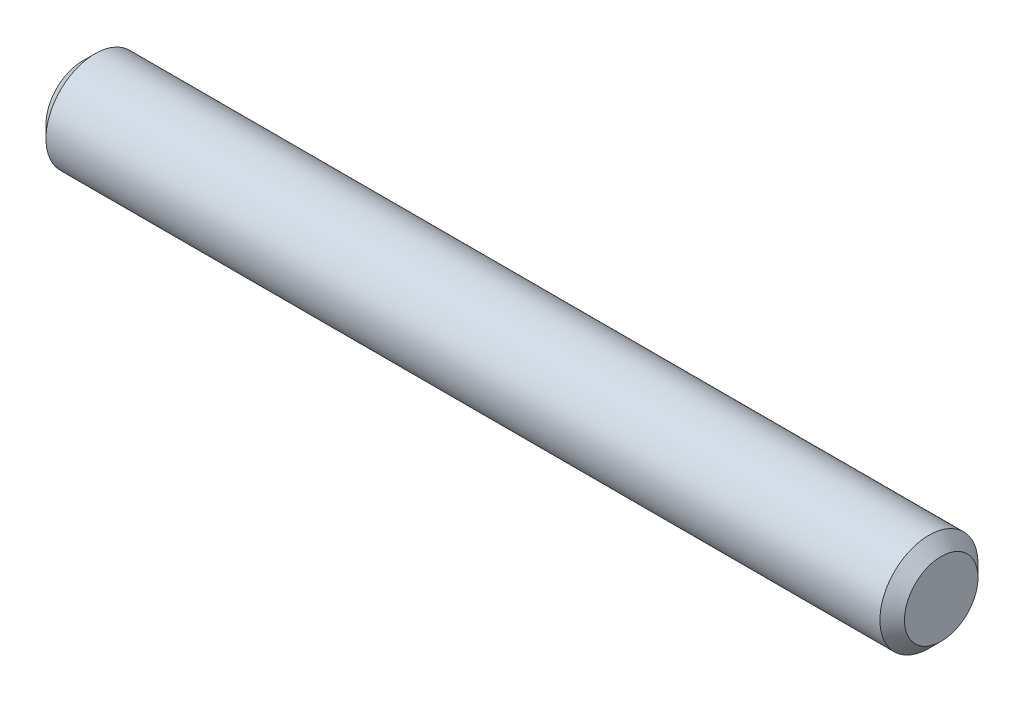
ISO-10303-21;
HEADER;
FILE_DESCRIPTION(('STEP AP214'),'2;1');
FILE_NAME('part.step','',(''),(''),'','','');
FILE_SCHEMA(('AUTOMOTIVE_DESIGN { 1 0 10303 214 1 1 1 1 }'));
ENDSEC;
DATA;
#1=APPLICATION_CONTEXT('core data for automotive mechanical design processes');
#2=APPLICATION_PROTOCOL_DEFINITION('international standard','automotive_design',2000,#1);
#3=PRODUCT_CONTEXT('',#1,'mechanical');
#4=PRODUCT('Part','Part','',(#3));
#5=PRODUCT_RELATED_PRODUCT_CATEGORY('part','',(#4));
#6=PRODUCT_DEFINITION_FORMATION('','',#4);
#7=PRODUCT_DEFINITION_CONTEXT('part definition',#1,'design');
#8=PRODUCT_DEFINITION('design','',#6,#7);
#9=PRODUCT_DEFINITION_SHAPE('','',#8);
#10=(LENGTH_UNIT() NAMED_UNIT(*) SI_UNIT(.MILLI.,.METRE.));
#11=(NAMED_UNIT(*) PLANE_ANGLE_UNIT() SI_UNIT($,.RADIAN.));
#12=(NAMED_UNIT(*) SI_UNIT($,.STERADIAN.) SOLID_ANGLE_UNIT());
#13=UNCERTAINTY_MEASURE_WITH_UNIT(LENGTH_MEASURE(1.E-05),#10,'distance_accuracy_value','');
#14=(GEOMETRIC_REPRESENTATION_CONTEXT(3) GLOBAL_UNCERTAINTY_ASSIGNED_CONTEXT((#13)) GLOBAL_UNIT_ASSIGNED_CONTEXT((#10,
#11,#12)) REPRESENTATION_CONTEXT('',''));
#15=CARTESIAN_POINT('',(0.,0.,0.));
#16=DIRECTION('',(0.,0.,1.));
#17=DIRECTION('',(1.,0.,0.));
#18=AXIS2_PLACEMENT_3D('',#15,#16,#17);
#19=CARTESIAN_POINT('',(17.5,0.,0.));
#20=DIRECTION('',(-1.,0.,0.));
#21=DIRECTION('',(0.,0.,1.));
#22=AXIS2_PLACEMENT_3D('',#19,#20,#21);
#23=CYLINDRICAL_SURFACE('',#22,2.);
#24=CARTESIAN_POINT('',(-17.,0.,0.));
#25=DIRECTION('',(1.,0.,0.));
#26=DIRECTION('',(0.,0.,-1.));
#27=AXIS2_PLACEMENT_3D('',#24,#25,#26);
#28=CIRCLE('',#27,2.);
#29=CARTESIAN_POINT('',(-17.,0.,-2.));
#30=VERTEX_POINT('',#29);
#31=EDGE_CURVE('E50',#30,#30,#28,.T.);
#32=ORIENTED_EDGE('',*,*,#31,.T.);
#33=EDGE_LOOP('',(#32));
#34=FACE_BOUND('',#33,.T.);
#35=CARTESIAN_POINT('',(17.,0.,0.));
#36=DIRECTION('',(1.,0.,0.));
#37=DIRECTION('',(0.,0.,-1.));
#38=AXIS2_PLACEMENT_3D('',#35,#36,#37);
#39=CIRCLE('',#38,2.);
#40=CARTESIAN_POINT('',(17.,0.,-2.));
#41=VERTEX_POINT('',#40);
#42=EDGE_CURVE('E54',#41,#41,#39,.F.);
#43=ORIENTED_EDGE('',*,*,#42,.T.);
#44=EDGE_LOOP('',(#43));
#45=FACE_BOUND('',#44,.T.);
#46=ADVANCED_FACE('F37',(#34,#45),#23,.T.);
#47=CARTESIAN_POINT('',(17.5,0.,0.));
#48=DIRECTION('',(1.,0.,0.));
#49=DIRECTION('',(0.,0.,-1.));
#50=AXIS2_PLACEMENT_3D('',#47,#48,#49);
#51=PLANE('',#50);
#52=CARTESIAN_POINT('',(17.5,0.,0.));
#53=DIRECTION('',(1.,0.,0.));
#54=DIRECTION('',(0.,0.,-1.));
#55=AXIS2_PLACEMENT_3D('',#52,#53,#54);
#56=CIRCLE('',#55,1.5);
#57=CARTESIAN_POINT('',(17.5,0.,-1.5));
#58=VERTEX_POINT('',#57);
#59=EDGE_CURVE('E10',#58,#58,#56,.T.);
#60=ORIENTED_EDGE('',*,*,#59,.T.);
#61=EDGE_LOOP('',(#60));
#62=FACE_BOUND('',#61,.T.);
#63=ADVANCED_FACE('F69',(#62),#51,.T.);
#64=CARTESIAN_POINT('',(-17.5,0.,0.));
#65=DIRECTION('',(1.,0.,0.));
#66=DIRECTION('',(0.,0.,-1.));
#67=AXIS2_PLACEMENT_3D('',#64,#65,#66);
#68=PLANE('',#67);
#69=CARTESIAN_POINT('',(-17.5,0.,0.));
#70=DIRECTION('',(1.,0.,0.));
#71=DIRECTION('',(0.,0.,-1.));
#72=AXIS2_PLACEMENT_3D('',#69,#70,#71);
#73=CIRCLE('',#72,1.49999999999999);
#74=CARTESIAN_POINT('',(-17.5,0.,-1.49999999999999));
#75=VERTEX_POINT('',#74);
#76=EDGE_CURVE('E45',#75,#75,#73,.F.);
#77=ORIENTED_EDGE('',*,*,#76,.T.);
#78=EDGE_LOOP('',(#77));
#79=FACE_BOUND('',#78,.T.);
#80=ADVANCED_FACE('F67',(#79),#68,.F.);
#81=CARTESIAN_POINT('',(-17.,0.,0.));
#82=DIRECTION('',(1.,0.,0.));
#83=DIRECTION('',(0.,0.,-1.));
#84=AXIS2_PLACEMENT_3D('',#81,#82,#83);
#85=CONICAL_SURFACE('',#84,2.,0.785398163397457);
#86=ORIENTED_EDGE('',*,*,#76,.F.);
#87=EDGE_LOOP('',(#86));
#88=FACE_BOUND('',#87,.T.);
#89=ORIENTED_EDGE('',*,*,#31,.F.);
#90=EDGE_LOOP('',(#89));
#91=FACE_BOUND('',#90,.T.);
#92=ADVANCED_FACE('F63',(#88,#91),#85,.T.);
#93=CARTESIAN_POINT('',(17.5,0.,0.));
#94=DIRECTION('',(-1.,0.,0.));
#95=DIRECTION('',(0.,0.,1.));
#96=AXIS2_PLACEMENT_3D('',#93,#94,#95);
#97=CONICAL_SURFACE('',#96,1.5,0.785398163397443);
#98=ORIENTED_EDGE('',*,*,#42,.F.);
#99=EDGE_LOOP('',(#98));
#100=FACE_BOUND('',#99,.T.);
#101=ORIENTED_EDGE('',*,*,#59,.F.);
#102=EDGE_LOOP('',(#101));
#103=FACE_BOUND('',#102,.T.);
#104=ADVANCED_FACE('F39',(#100,#103),#97,.T.);
#105=CLOSED_SHELL('',(#46,#63,#80,#92,#104));
#106=MANIFOLD_SOLID_BREP('B2',#105);
#107=ADVANCED_BREP_SHAPE_REPRESENTATION('',(#18,#106),#14);
#108=SHAPE_DEFINITION_REPRESENTATION(#9,#107);
ENDSEC;
END-ISO-10303-21;
